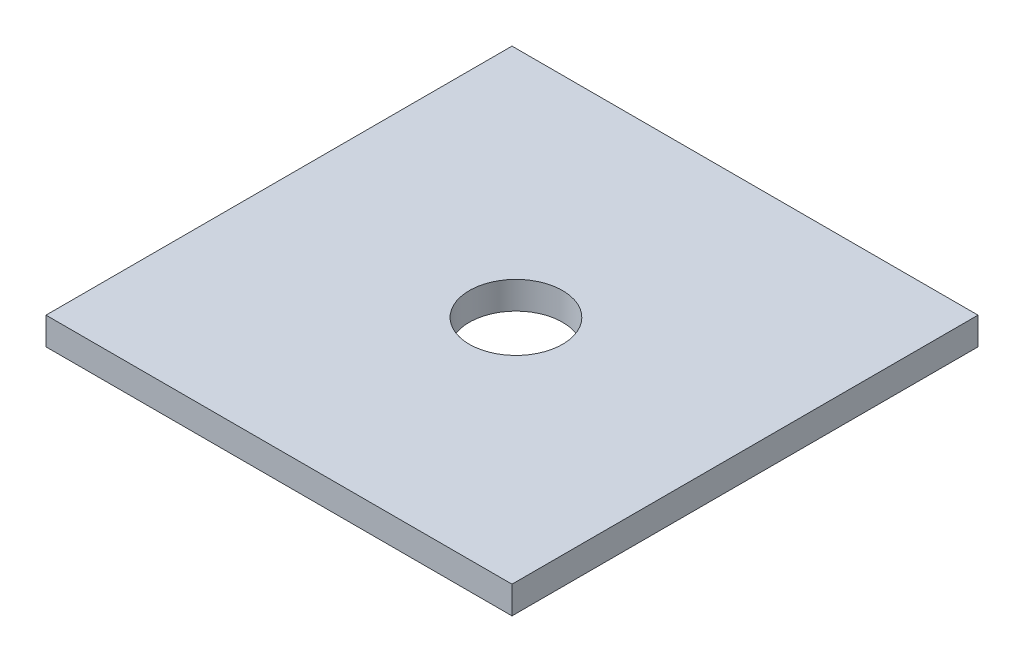
ISO-10303-21;
HEADER;
FILE_DESCRIPTION(('STEP AP214'),'2;1');
FILE_NAME('part.step','',(''),(''),'','','');
FILE_SCHEMA(('AUTOMOTIVE_DESIGN { 1 0 10303 214 1 1 1 1 }'));
ENDSEC;
DATA;
#1=APPLICATION_CONTEXT('core data for automotive mechanical design processes');
#2=APPLICATION_PROTOCOL_DEFINITION('international standard','automotive_design',2000,#1);
#3=PRODUCT_CONTEXT('',#1,'mechanical');
#4=PRODUCT('Part','Part','',(#3));
#5=PRODUCT_RELATED_PRODUCT_CATEGORY('part','',(#4));
#6=PRODUCT_DEFINITION_FORMATION('','',#4);
#7=PRODUCT_DEFINITION_CONTEXT('part definition',#1,'design');
#8=PRODUCT_DEFINITION('design','',#6,#7);
#9=PRODUCT_DEFINITION_SHAPE('','',#8);
#10=(LENGTH_UNIT() NAMED_UNIT(*) SI_UNIT(.MILLI.,.METRE.));
#11=(NAMED_UNIT(*) PLANE_ANGLE_UNIT() SI_UNIT($,.RADIAN.));
#12=(NAMED_UNIT(*) SI_UNIT($,.STERADIAN.) SOLID_ANGLE_UNIT());
#13=UNCERTAINTY_MEASURE_WITH_UNIT(LENGTH_MEASURE(1.E-05),#10,'distance_accuracy_value','');
#14=(GEOMETRIC_REPRESENTATION_CONTEXT(3) GLOBAL_UNCERTAINTY_ASSIGNED_CONTEXT((#13)) GLOBAL_UNIT_ASSIGNED_CONTEXT((#10,
#11,#12)) REPRESENTATION_CONTEXT('',''));
#15=CARTESIAN_POINT('',(0.,0.,0.));
#16=DIRECTION('',(0.,0.,1.));
#17=DIRECTION('',(1.,0.,0.));
#18=AXIS2_PLACEMENT_3D('',#15,#16,#17);
#19=CARTESIAN_POINT('',(-25.4237288135593,2.95,-20.7097457627119));
#20=DIRECTION('',(1.,0.,0.));
#21=DIRECTION('',(0.,0.,-1.));
#22=AXIS2_PLACEMENT_3D('',#19,#20,#21);
#23=PLANE('',#22);
#24=DIRECTION('',(0.,0.,1.));
#25=VECTOR('',#24,1.);
#26=CARTESIAN_POINT('',(-25.4237288135593,0.,-20.7097457627119));
#27=LINE('',#26,#25);
#28=CARTESIAN_POINT('',(-25.4237288135593,0.,-20.7097457627119));
#29=VERTEX_POINT('',#28);
#30=CARTESIAN_POINT('',(-25.4237288135593,0.,29.2902542372881));
#31=VERTEX_POINT('',#30);
#32=EDGE_CURVE('E98',#29,#31,#27,.T.);
#33=ORIENTED_EDGE('',*,*,#32,.T.);
#34=DIRECTION('',(0.,-1.,0.));
#35=VECTOR('',#34,1.);
#36=CARTESIAN_POINT('',(-25.4237288135593,2.95,29.2902542372881));
#37=LINE('',#36,#35);
#38=CARTESIAN_POINT('',(-25.4237288135593,2.95,29.2902542372881));
#39=VERTEX_POINT('',#38);
#40=EDGE_CURVE('E11',#39,#31,#37,.T.);
#41=ORIENTED_EDGE('',*,*,#40,.F.);
#42=DIRECTION('',(0.,0.,1.));
#43=VECTOR('',#42,1.);
#44=CARTESIAN_POINT('',(-25.4237288135593,2.95,-20.7097457627119));
#45=LINE('',#44,#43);
#46=CARTESIAN_POINT('',(-25.4237288135593,2.95,-20.7097457627119));
#47=VERTEX_POINT('',#46);
#48=EDGE_CURVE('E85',#47,#39,#45,.T.);
#49=ORIENTED_EDGE('',*,*,#48,.F.);
#50=DIRECTION('',(0.,-1.,0.));
#51=VECTOR('',#50,1.);
#52=CARTESIAN_POINT('',(-25.4237288135593,2.95,-20.7097457627119));
#53=LINE('',#52,#51);
#54=EDGE_CURVE('E94',#47,#29,#53,.T.);
#55=ORIENTED_EDGE('',*,*,#54,.T.);
#56=EDGE_LOOP('',(#33,#41,#49,#55));
#57=FACE_BOUND('',#56,.T.);
#58=ADVANCED_FACE('F33',(#57),#23,.F.);
#59=CARTESIAN_POINT('',(-25.4237288135593,2.95,29.2902542372881));
#60=DIRECTION('',(0.,0.,-1.));
#61=DIRECTION('',(-1.,0.,0.));
#62=AXIS2_PLACEMENT_3D('',#59,#60,#61);
#63=PLANE('',#62);
#64=DIRECTION('',(1.,0.,0.));
#65=VECTOR('',#64,1.);
#66=CARTESIAN_POINT('',(-25.4237288135593,0.,29.2902542372881));
#67=LINE('',#66,#65);
#68=CARTESIAN_POINT('',(24.5762711864407,0.,29.2902542372881));
#69=VERTEX_POINT('',#68);
#70=EDGE_CURVE('E89',#31,#69,#67,.T.);
#71=ORIENTED_EDGE('',*,*,#70,.T.);
#72=DIRECTION('',(0.,-1.,0.));
#73=VECTOR('',#72,1.);
#74=CARTESIAN_POINT('',(24.5762711864407,2.95,29.2902542372881));
#75=LINE('',#74,#73);
#76=CARTESIAN_POINT('',(24.5762711864407,2.95,29.2902542372881));
#77=VERTEX_POINT('',#76);
#78=EDGE_CURVE('E42',#77,#69,#75,.T.);
#79=ORIENTED_EDGE('',*,*,#78,.F.);
#80=DIRECTION('',(1.,0.,0.));
#81=VECTOR('',#80,1.);
#82=CARTESIAN_POINT('',(-25.4237288135593,2.95,29.2902542372881));
#83=LINE('',#82,#81);
#84=EDGE_CURVE('E80',#39,#77,#83,.T.);
#85=ORIENTED_EDGE('',*,*,#84,.F.);
#86=ORIENTED_EDGE('',*,*,#40,.T.);
#87=EDGE_LOOP('',(#71,#79,#85,#86));
#88=FACE_BOUND('',#87,.T.);
#89=ADVANCED_FACE('F88',(#88),#63,.F.);
#90=CARTESIAN_POINT('',(24.5762711864407,2.95,-20.7097457627119));
#91=DIRECTION('',(-1.,0.,0.));
#92=DIRECTION('',(0.,0.,1.));
#93=AXIS2_PLACEMENT_3D('',#90,#91,#92);
#94=PLANE('',#93);
#95=DIRECTION('',(0.,0.,-1.));
#96=VECTOR('',#95,1.);
#97=CARTESIAN_POINT('',(24.5762711864407,0.,-20.7097457627119));
#98=LINE('',#97,#96);
#99=CARTESIAN_POINT('',(24.5762711864407,0.,-20.7097457627119));
#100=VERTEX_POINT('',#99);
#101=EDGE_CURVE('E67',#69,#100,#98,.T.);
#102=ORIENTED_EDGE('',*,*,#101,.T.);
#103=DIRECTION('',(0.,-1.,0.));
#104=VECTOR('',#103,1.);
#105=CARTESIAN_POINT('',(24.5762711864407,2.95,-20.7097457627119));
#106=LINE('',#105,#104);
#107=CARTESIAN_POINT('',(24.5762711864407,2.95,-20.7097457627119));
#108=VERTEX_POINT('',#107);
#109=EDGE_CURVE('E90',#108,#100,#106,.T.);
#110=ORIENTED_EDGE('',*,*,#109,.F.);
#111=DIRECTION('',(0.,0.,-1.));
#112=VECTOR('',#111,1.);
#113=CARTESIAN_POINT('',(24.5762711864407,2.95,-20.7097457627119));
#114=LINE('',#113,#112);
#115=EDGE_CURVE('E83',#77,#108,#114,.T.);
#116=ORIENTED_EDGE('',*,*,#115,.F.);
#117=ORIENTED_EDGE('',*,*,#78,.T.);
#118=EDGE_LOOP('',(#102,#110,#116,#117));
#119=FACE_BOUND('',#118,.T.);
#120=ADVANCED_FACE('F92',(#119),#94,.F.);
#121=CARTESIAN_POINT('',(-25.4237288135593,2.95,-20.7097457627119));
#122=DIRECTION('',(0.,0.,1.));
#123=DIRECTION('',(1.,0.,0.));
#124=AXIS2_PLACEMENT_3D('',#121,#122,#123);
#125=PLANE('',#124);
#126=DIRECTION('',(-1.,0.,0.));
#127=VECTOR('',#126,1.);
#128=CARTESIAN_POINT('',(-25.4237288135593,0.,-20.7097457627119));
#129=LINE('',#128,#127);
#130=EDGE_CURVE('E73',#100,#29,#129,.T.);
#131=ORIENTED_EDGE('',*,*,#130,.T.);
#132=ORIENTED_EDGE('',*,*,#54,.F.);
#133=DIRECTION('',(-1.,0.,0.));
#134=VECTOR('',#133,1.);
#135=CARTESIAN_POINT('',(-25.4237288135593,2.95,-20.7097457627119));
#136=LINE('',#135,#134);
#137=EDGE_CURVE('E50',#108,#47,#136,.T.);
#138=ORIENTED_EDGE('',*,*,#137,.F.);
#139=ORIENTED_EDGE('',*,*,#109,.T.);
#140=EDGE_LOOP('',(#131,#132,#138,#139));
#141=FACE_BOUND('',#140,.T.);
#142=ADVANCED_FACE('F105',(#141),#125,.F.);
#143=CARTESIAN_POINT('',(0.,2.95,0.));
#144=DIRECTION('',(0.,1.,0.));
#145=DIRECTION('',(0.,0.,1.));
#146=AXIS2_PLACEMENT_3D('',#143,#144,#145);
#147=PLANE('',#146);
#148=CARTESIAN_POINT('',(0.,2.95,4.29025423728814));
#149=DIRECTION('',(0.,1.,0.));
#150=DIRECTION('',(0.,0.,1.));
#151=AXIS2_PLACEMENT_3D('',#148,#149,#150);
#152=CIRCLE('',#151,5.);
#153=CARTESIAN_POINT('',(0.,2.95,9.29025423728814));
#154=VERTEX_POINT('',#153);
#155=EDGE_CURVE('E111',#154,#154,#152,.T.);
#156=ORIENTED_EDGE('',*,*,#155,.F.);
#157=EDGE_LOOP('',(#156));
#158=FACE_BOUND('',#157,.T.);
#159=ORIENTED_EDGE('',*,*,#48,.T.);
#160=ORIENTED_EDGE('',*,*,#84,.T.);
#161=ORIENTED_EDGE('',*,*,#115,.T.);
#162=ORIENTED_EDGE('',*,*,#137,.T.);
#163=EDGE_LOOP('',(#159,#160,#161,#162));
#164=FACE_BOUND('',#163,.T.);
#165=ADVANCED_FACE('F81',(#158,#164),#147,.T.);
#166=CARTESIAN_POINT('',(0.,0.,0.));
#167=DIRECTION('',(0.,1.,0.));
#168=DIRECTION('',(0.,0.,1.));
#169=AXIS2_PLACEMENT_3D('',#166,#167,#168);
#170=PLANE('',#169);
#171=CARTESIAN_POINT('',(0.,0.,4.29025423728814));
#172=DIRECTION('',(0.,1.,0.));
#173=DIRECTION('',(0.,0.,1.));
#174=AXIS2_PLACEMENT_3D('',#171,#172,#173);
#175=CIRCLE('',#174,5.);
#176=CARTESIAN_POINT('',(0.,0.,9.29025423728814));
#177=VERTEX_POINT('',#176);
#178=EDGE_CURVE('E36',#177,#177,#175,.T.);
#179=ORIENTED_EDGE('',*,*,#178,.T.);
#180=EDGE_LOOP('',(#179));
#181=FACE_BOUND('',#180,.T.);
#182=ORIENTED_EDGE('',*,*,#32,.F.);
#183=ORIENTED_EDGE('',*,*,#130,.F.);
#184=ORIENTED_EDGE('',*,*,#101,.F.);
#185=ORIENTED_EDGE('',*,*,#70,.F.);
#186=EDGE_LOOP('',(#182,#183,#184,#185));
#187=FACE_BOUND('',#186,.T.);
#188=ADVANCED_FACE('F108',(#181,#187),#170,.F.);
#189=CARTESIAN_POINT('',(0.,-3.91,4.29025423728814));
#190=DIRECTION('',(0.,1.,0.));
#191=DIRECTION('',(0.,0.,1.));
#192=AXIS2_PLACEMENT_3D('',#189,#190,#191);
#193=CYLINDRICAL_SURFACE('',#192,5.);
#194=ORIENTED_EDGE('',*,*,#155,.T.);
#195=EDGE_LOOP('',(#194));
#196=FACE_BOUND('',#195,.T.);
#197=ORIENTED_EDGE('',*,*,#178,.F.);
#198=EDGE_LOOP('',(#197));
#199=FACE_BOUND('',#198,.T.);
#200=ADVANCED_FACE('F119',(#196,#199),#193,.F.);
#201=CLOSED_SHELL('',(#58,#89,#120,#142,#165,#188,#200));
#202=MANIFOLD_SOLID_BREP('B2',#201);
#203=ADVANCED_BREP_SHAPE_REPRESENTATION('',(#18,#202),#14);
#204=SHAPE_DEFINITION_REPRESENTATION(#9,#203);
ENDSEC;
END-ISO-10303-21;
